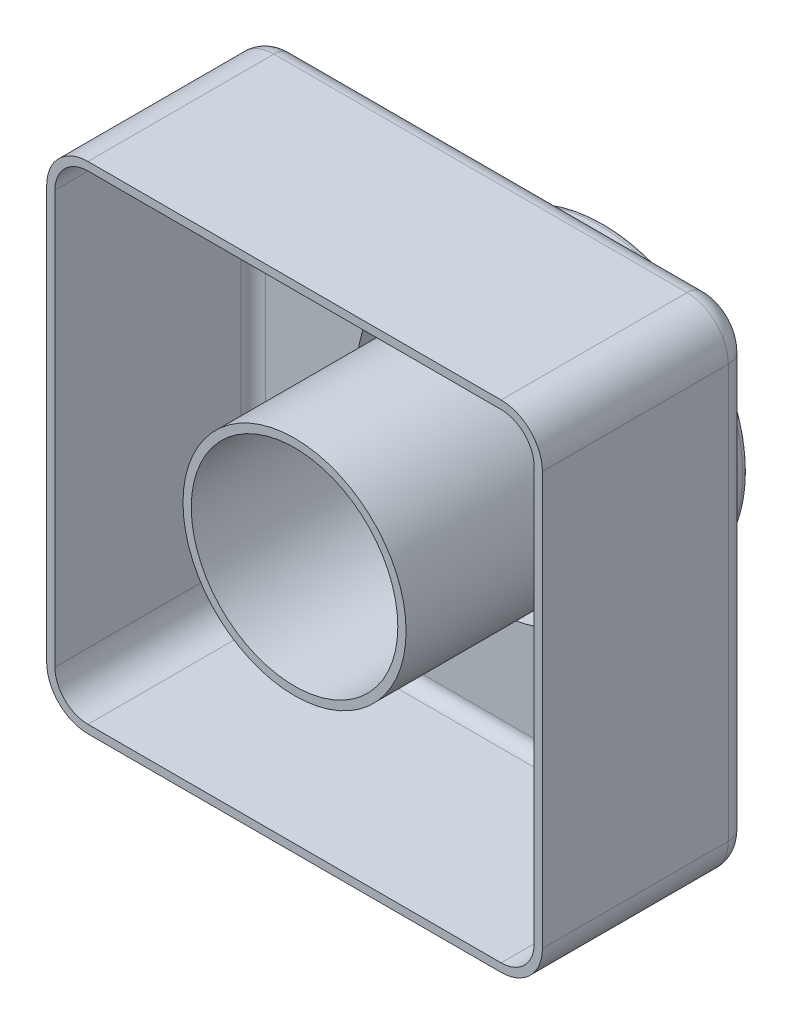
ISO-10303-21;
HEADER;
FILE_DESCRIPTION(('STEP AP214'),'2;1');
FILE_NAME('part.step','',(''),(''),'','','');
FILE_SCHEMA(('AUTOMOTIVE_DESIGN { 1 0 10303 214 1 1 1 1 }'));
ENDSEC;
DATA;
#1=APPLICATION_CONTEXT('core data for automotive mechanical design processes');
#2=APPLICATION_PROTOCOL_DEFINITION('international standard','automotive_design',2000,#1);
#3=PRODUCT_CONTEXT('',#1,'mechanical');
#4=PRODUCT('Part','Part','',(#3));
#5=PRODUCT_RELATED_PRODUCT_CATEGORY('part','',(#4));
#6=PRODUCT_DEFINITION_FORMATION('','',#4);
#7=PRODUCT_DEFINITION_CONTEXT('part definition',#1,'design');
#8=PRODUCT_DEFINITION('design','',#6,#7);
#9=PRODUCT_DEFINITION_SHAPE('','',#8);
#10=(LENGTH_UNIT() NAMED_UNIT(*) SI_UNIT(.MILLI.,.METRE.));
#11=(NAMED_UNIT(*) PLANE_ANGLE_UNIT() SI_UNIT($,.RADIAN.));
#12=(NAMED_UNIT(*) SI_UNIT($,.STERADIAN.) SOLID_ANGLE_UNIT());
#13=UNCERTAINTY_MEASURE_WITH_UNIT(LENGTH_MEASURE(1.E-05),#10,'distance_accuracy_value','');
#14=(GEOMETRIC_REPRESENTATION_CONTEXT(3) GLOBAL_UNCERTAINTY_ASSIGNED_CONTEXT((#13)) GLOBAL_UNIT_ASSIGNED_CONTEXT((#10,
#11,#12)) REPRESENTATION_CONTEXT('',''));
#15=CARTESIAN_POINT('',(0.,0.,0.));
#16=DIRECTION('',(0.,0.,1.));
#17=DIRECTION('',(1.,0.,0.));
#18=AXIS2_PLACEMENT_3D('',#15,#16,#17);
#19=CARTESIAN_POINT('',(0.,0.,50.));
#20=DIRECTION('',(0.,0.,1.));
#21=DIRECTION('',(1.,0.,0.));
#22=AXIS2_PLACEMENT_3D('',#19,#20,#21);
#23=PLANE('',#22);
#24=CARTESIAN_POINT('',(0.,0.,50.));
#25=DIRECTION('',(0.,0.,1.));
#26=DIRECTION('',(1.,0.,0.));
#27=AXIS2_PLACEMENT_3D('',#24,#25,#26);
#28=CIRCLE('',#27,27.);
#29=CARTESIAN_POINT('',(27.,0.,50.));
#30=VERTEX_POINT('',#29);
#31=EDGE_CURVE('E251',#30,#30,#28,.F.);
#32=ORIENTED_EDGE('',*,*,#31,.F.);
#33=EDGE_LOOP('',(#32));
#34=FACE_BOUND('',#33,.T.);
#35=CARTESIAN_POINT('',(0.,0.,50.));
#36=DIRECTION('',(0.,0.,-1.));
#37=DIRECTION('',(-1.,0.,0.));
#38=AXIS2_PLACEMENT_3D('',#35,#36,#37);
#39=CIRCLE('',#38,25.);
#40=CARTESIAN_POINT('',(-25.,0.,50.));
#41=VERTEX_POINT('',#40);
#42=EDGE_CURVE('E345',#41,#41,#39,.T.);
#43=ORIENTED_EDGE('',*,*,#42,.T.);
#44=EDGE_LOOP('',(#43));
#45=FACE_BOUND('',#44,.T.);
#46=ADVANCED_FACE('F41',(#34,#45),#23,.T.);
#47=CARTESIAN_POINT('',(-60.,60.,50.));
#48=DIRECTION('',(1.,0.,0.));
#49=DIRECTION('',(0.,1.,0.));
#50=AXIS2_PLACEMENT_3D('',#47,#48,#49);
#51=PLANE('',#50);
#52=DIRECTION('',(0.,0.,-1.));
#53=VECTOR('',#52,1.);
#54=CARTESIAN_POINT('',(-60.,50.,50.));
#55=LINE('',#54,#53);
#56=CARTESIAN_POINT('',(-60.,50.,50.));
#57=VERTEX_POINT('',#56);
#58=CARTESIAN_POINT('',(-60.,50.,5.));
#59=VERTEX_POINT('',#58);
#60=EDGE_CURVE('E392',#57,#59,#55,.T.);
#61=ORIENTED_EDGE('',*,*,#60,.T.);
#62=DIRECTION('',(0.,-1.,0.));
#63=VECTOR('',#62,1.);
#64=CARTESIAN_POINT('',(-60.,60.,5.));
#65=LINE('',#64,#63);
#66=CARTESIAN_POINT('',(-60.,-50.,5.));
#67=VERTEX_POINT('',#66);
#68=EDGE_CURVE('E464',#59,#67,#65,.T.);
#69=ORIENTED_EDGE('',*,*,#68,.T.);
#70=DIRECTION('',(0.,0.,-1.));
#71=VECTOR('',#70,1.);
#72=CARTESIAN_POINT('',(-60.,-50.,50.));
#73=LINE('',#72,#71);
#74=CARTESIAN_POINT('',(-60.,-50.,50.));
#75=VERTEX_POINT('',#74);
#76=EDGE_CURVE('E395',#67,#75,#73,.F.);
#77=ORIENTED_EDGE('',*,*,#76,.T.);
#78=DIRECTION('',(0.,-1.,0.));
#79=VECTOR('',#78,1.);
#80=CARTESIAN_POINT('',(-60.,60.,50.));
#81=LINE('',#80,#79);
#82=EDGE_CURVE('E349',#57,#75,#81,.T.);
#83=ORIENTED_EDGE('',*,*,#82,.F.);
#84=EDGE_LOOP('',(#61,#69,#77,#83));
#85=FACE_BOUND('',#84,.T.);
#86=ADVANCED_FACE('F556',(#85),#51,.F.);
#87=CARTESIAN_POINT('',(-60.,-60.,50.));
#88=DIRECTION('',(0.,1.,0.));
#89=DIRECTION('',(0.,0.,1.));
#90=AXIS2_PLACEMENT_3D('',#87,#88,#89);
#91=PLANE('',#90);
#92=DIRECTION('',(0.,0.,-1.));
#93=VECTOR('',#92,1.);
#94=CARTESIAN_POINT('',(-50.,-60.,50.));
#95=LINE('',#94,#93);
#96=CARTESIAN_POINT('',(-50.,-60.,50.));
#97=VERTEX_POINT('',#96);
#98=CARTESIAN_POINT('',(-50.,-60.,5.));
#99=VERTEX_POINT('',#98);
#100=EDGE_CURVE('E388',#97,#99,#95,.T.);
#101=ORIENTED_EDGE('',*,*,#100,.T.);
#102=DIRECTION('',(1.,0.,0.));
#103=VECTOR('',#102,1.);
#104=CARTESIAN_POINT('',(-60.,-60.,5.));
#105=LINE('',#104,#103);
#106=CARTESIAN_POINT('',(50.,-60.,5.));
#107=VERTEX_POINT('',#106);
#108=EDGE_CURVE('E461',#99,#107,#105,.T.);
#109=ORIENTED_EDGE('',*,*,#108,.T.);
#110=DIRECTION('',(0.,0.,-1.));
#111=VECTOR('',#110,1.);
#112=CARTESIAN_POINT('',(50.,-60.,50.));
#113=LINE('',#112,#111);
#114=CARTESIAN_POINT('',(50.,-60.,50.));
#115=VERTEX_POINT('',#114);
#116=EDGE_CURVE('E385',#107,#115,#113,.F.);
#117=ORIENTED_EDGE('',*,*,#116,.T.);
#118=DIRECTION('',(1.,0.,0.));
#119=VECTOR('',#118,1.);
#120=CARTESIAN_POINT('',(-60.,-60.,50.));
#121=LINE('',#120,#119);
#122=EDGE_CURVE('E359',#97,#115,#121,.T.);
#123=ORIENTED_EDGE('',*,*,#122,.F.);
#124=EDGE_LOOP('',(#101,#109,#117,#123));
#125=FACE_BOUND('',#124,.T.);
#126=ADVANCED_FACE('F516',(#125),#91,.F.);
#127=CARTESIAN_POINT('',(60.,60.,50.));
#128=DIRECTION('',(-1.,0.,0.));
#129=DIRECTION('',(0.,-1.,0.));
#130=AXIS2_PLACEMENT_3D('',#127,#128,#129);
#131=PLANE('',#130);
#132=DIRECTION('',(0.,0.,-1.));
#133=VECTOR('',#132,1.);
#134=CARTESIAN_POINT('',(60.,-50.,50.));
#135=LINE('',#134,#133);
#136=CARTESIAN_POINT('',(60.,-50.,50.));
#137=VERTEX_POINT('',#136);
#138=CARTESIAN_POINT('',(60.,-50.,5.));
#139=VERTEX_POINT('',#138);
#140=EDGE_CURVE('E413',#137,#139,#135,.T.);
#141=ORIENTED_EDGE('',*,*,#140,.T.);
#142=DIRECTION('',(0.,1.,0.));
#143=VECTOR('',#142,1.);
#144=CARTESIAN_POINT('',(60.,60.,5.));
#145=LINE('',#144,#143);
#146=CARTESIAN_POINT('',(60.,50.,5.));
#147=VERTEX_POINT('',#146);
#148=EDGE_CURVE('E51',#139,#147,#145,.T.);
#149=ORIENTED_EDGE('',*,*,#148,.T.);
#150=DIRECTION('',(0.,0.,-1.));
#151=VECTOR('',#150,1.);
#152=CARTESIAN_POINT('',(60.,50.,50.));
#153=LINE('',#152,#151);
#154=CARTESIAN_POINT('',(60.,50.,50.));
#155=VERTEX_POINT('',#154);
#156=EDGE_CURVE('E410',#147,#155,#153,.F.);
#157=ORIENTED_EDGE('',*,*,#156,.T.);
#158=DIRECTION('',(0.,1.,0.));
#159=VECTOR('',#158,1.);
#160=CARTESIAN_POINT('',(60.,60.,50.));
#161=LINE('',#160,#159);
#162=EDGE_CURVE('E363',#137,#155,#161,.T.);
#163=ORIENTED_EDGE('',*,*,#162,.F.);
#164=EDGE_LOOP('',(#141,#149,#157,#163));
#165=FACE_BOUND('',#164,.T.);
#166=ADVANCED_FACE('F529',(#165),#131,.F.);
#167=CARTESIAN_POINT('',(-60.,60.,50.));
#168=DIRECTION('',(0.,-1.,0.));
#169=DIRECTION('',(0.,0.,-1.));
#170=AXIS2_PLACEMENT_3D('',#167,#168,#169);
#171=PLANE('',#170);
#172=DIRECTION('',(0.,0.,-1.));
#173=VECTOR('',#172,1.);
#174=CARTESIAN_POINT('',(50.,60.,50.));
#175=LINE('',#174,#173);
#176=CARTESIAN_POINT('',(50.,60.,50.));
#177=VERTEX_POINT('',#176);
#178=CARTESIAN_POINT('',(50.,60.,5.));
#179=VERTEX_POINT('',#178);
#180=EDGE_CURVE('E417',#177,#179,#175,.T.);
#181=ORIENTED_EDGE('',*,*,#180,.T.);
#182=DIRECTION('',(-1.,0.,0.));
#183=VECTOR('',#182,1.);
#184=CARTESIAN_POINT('',(-60.,60.,5.));
#185=LINE('',#184,#183);
#186=CARTESIAN_POINT('',(-50.,60.,5.));
#187=VERTEX_POINT('',#186);
#188=EDGE_CURVE('E11',#179,#187,#185,.T.);
#189=ORIENTED_EDGE('',*,*,#188,.T.);
#190=DIRECTION('',(0.,0.,-1.));
#191=VECTOR('',#190,1.);
#192=CARTESIAN_POINT('',(-50.,60.,50.));
#193=LINE('',#192,#191);
#194=CARTESIAN_POINT('',(-50.,60.,50.));
#195=VERTEX_POINT('',#194);
#196=EDGE_CURVE('E421',#187,#195,#193,.F.);
#197=ORIENTED_EDGE('',*,*,#196,.T.);
#198=DIRECTION('',(-1.,0.,0.));
#199=VECTOR('',#198,1.);
#200=CARTESIAN_POINT('',(-60.,60.,50.));
#201=LINE('',#200,#199);
#202=EDGE_CURVE('E355',#177,#195,#201,.T.);
#203=ORIENTED_EDGE('',*,*,#202,.F.);
#204=EDGE_LOOP('',(#181,#189,#197,#203));
#205=FACE_BOUND('',#204,.T.);
#206=ADVANCED_FACE('F551',(#205),#171,.F.);
#207=DIRECTION('',(0.,-1.,0.));
#208=VECTOR('',#207,1.);
#209=CARTESIAN_POINT('',(-58.,60.,50.));
#210=LINE('',#209,#208);
#211=CARTESIAN_POINT('',(-58.,50.,50.));
#212=VERTEX_POINT('',#211);
#213=CARTESIAN_POINT('',(-58.,-50.,50.));
#214=VERTEX_POINT('',#213);
#215=EDGE_CURVE('E228',#212,#214,#210,.T.);
#216=ORIENTED_EDGE('',*,*,#215,.F.);
#217=CARTESIAN_POINT('',(-50.,50.,50.));
#218=DIRECTION('',(0.,0.,1.));
#219=DIRECTION('',(1.,0.,0.));
#220=AXIS2_PLACEMENT_3D('',#217,#218,#219);
#221=CIRCLE('',#220,8.);
#222=CARTESIAN_POINT('',(-50.,58.,50.));
#223=VERTEX_POINT('',#222);
#224=EDGE_CURVE('E335',#223,#212,#221,.T.);
#225=ORIENTED_EDGE('',*,*,#224,.F.);
#226=DIRECTION('',(-1.,0.,0.));
#227=VECTOR('',#226,1.);
#228=CARTESIAN_POINT('',(-60.,58.,50.));
#229=LINE('',#228,#227);
#230=CARTESIAN_POINT('',(50.,58.,50.));
#231=VERTEX_POINT('',#230);
#232=EDGE_CURVE('E59',#231,#223,#229,.T.);
#233=ORIENTED_EDGE('',*,*,#232,.F.);
#234=CARTESIAN_POINT('',(50.,50.,50.));
#235=DIRECTION('',(0.,0.,1.));
#236=DIRECTION('',(1.,0.,0.));
#237=AXIS2_PLACEMENT_3D('',#234,#235,#236);
#238=CIRCLE('',#237,8.);
#239=CARTESIAN_POINT('',(58.,50.,50.));
#240=VERTEX_POINT('',#239);
#241=EDGE_CURVE('E232',#240,#231,#238,.T.);
#242=ORIENTED_EDGE('',*,*,#241,.F.);
#243=DIRECTION('',(0.,1.,0.));
#244=VECTOR('',#243,1.);
#245=CARTESIAN_POINT('',(58.,60.,50.));
#246=LINE('',#245,#244);
#247=CARTESIAN_POINT('',(58.,-50.,50.));
#248=VERTEX_POINT('',#247);
#249=EDGE_CURVE('E332',#248,#240,#246,.T.);
#250=ORIENTED_EDGE('',*,*,#249,.F.);
#251=CARTESIAN_POINT('',(50.,-50.,50.));
#252=DIRECTION('',(0.,0.,1.));
#253=DIRECTION('',(1.,0.,0.));
#254=AXIS2_PLACEMENT_3D('',#251,#252,#253);
#255=CIRCLE('',#254,8.);
#256=CARTESIAN_POINT('',(50.,-58.,50.));
#257=VERTEX_POINT('',#256);
#258=EDGE_CURVE('E328',#257,#248,#255,.T.);
#259=ORIENTED_EDGE('',*,*,#258,.F.);
#260=DIRECTION('',(1.,0.,0.));
#261=VECTOR('',#260,1.);
#262=CARTESIAN_POINT('',(-60.,-58.,50.));
#263=LINE('',#262,#261);
#264=CARTESIAN_POINT('',(-50.,-58.,50.));
#265=VERTEX_POINT('',#264);
#266=EDGE_CURVE('E323',#265,#257,#263,.T.);
#267=ORIENTED_EDGE('',*,*,#266,.F.);
#268=CARTESIAN_POINT('',(-50.,-50.,50.));
#269=DIRECTION('',(0.,0.,1.));
#270=DIRECTION('',(1.,0.,0.));
#271=AXIS2_PLACEMENT_3D('',#268,#269,#270);
#272=CIRCLE('',#271,8.);
#273=EDGE_CURVE('E324',#214,#265,#272,.T.);
#274=ORIENTED_EDGE('',*,*,#273,.F.);
#275=EDGE_LOOP('',(#216,#225,#233,#242,#250,#259,#267,#274));
#276=FACE_BOUND('',#275,.T.);
#277=ORIENTED_EDGE('',*,*,#82,.T.);
#278=CARTESIAN_POINT('',(-50.,-50.,50.));
#279=DIRECTION('',(0.,0.,1.));
#280=DIRECTION('',(1.,0.,0.));
#281=AXIS2_PLACEMENT_3D('',#278,#279,#280);
#282=CIRCLE('',#281,10.);
#283=EDGE_CURVE('E407',#75,#97,#282,.T.);
#284=ORIENTED_EDGE('',*,*,#283,.T.);
#285=ORIENTED_EDGE('',*,*,#122,.T.);
#286=CARTESIAN_POINT('',(50.,-50.,50.));
#287=DIRECTION('',(0.,0.,1.));
#288=DIRECTION('',(1.,0.,0.));
#289=AXIS2_PLACEMENT_3D('',#286,#287,#288);
#290=CIRCLE('',#289,10.);
#291=EDGE_CURVE('E404',#115,#137,#290,.T.);
#292=ORIENTED_EDGE('',*,*,#291,.T.);
#293=ORIENTED_EDGE('',*,*,#162,.T.);
#294=CARTESIAN_POINT('',(50.,50.,50.));
#295=DIRECTION('',(0.,0.,1.));
#296=DIRECTION('',(1.,0.,0.));
#297=AXIS2_PLACEMENT_3D('',#294,#295,#296);
#298=CIRCLE('',#297,10.);
#299=EDGE_CURVE('E398',#155,#177,#298,.T.);
#300=ORIENTED_EDGE('',*,*,#299,.T.);
#301=ORIENTED_EDGE('',*,*,#202,.T.);
#302=CARTESIAN_POINT('',(-50.,50.,50.));
#303=DIRECTION('',(0.,0.,1.));
#304=DIRECTION('',(1.,0.,0.));
#305=AXIS2_PLACEMENT_3D('',#302,#303,#304);
#306=CIRCLE('',#305,10.);
#307=EDGE_CURVE('E401',#195,#57,#306,.T.);
#308=ORIENTED_EDGE('',*,*,#307,.T.);
#309=EDGE_LOOP('',(#277,#284,#285,#292,#293,#300,#301,#308));
#310=FACE_BOUND('',#309,.T.);
#311=ADVANCED_FACE('F520',(#276,#310),#23,.T.);
#312=CARTESIAN_POINT('',(0.,0.,0.));
#313=DIRECTION('',(0.,0.,1.));
#314=DIRECTION('',(1.,0.,0.));
#315=AXIS2_PLACEMENT_3D('',#312,#313,#314);
#316=PLANE('',#315);
#317=CARTESIAN_POINT('',(50.,-50.,0.));
#318=DIRECTION('',(0.,0.,1.));
#319=DIRECTION('',(1.,0.,0.));
#320=AXIS2_PLACEMENT_3D('',#317,#318,#319);
#321=CIRCLE('',#320,5.);
#322=CARTESIAN_POINT('',(55.,-50.,0.));
#323=VERTEX_POINT('',#322);
#324=CARTESIAN_POINT('',(50.,-55.,0.));
#325=VERTEX_POINT('',#324);
#326=EDGE_CURVE('E443',#323,#325,#321,.F.);
#327=ORIENTED_EDGE('',*,*,#326,.T.);
#328=DIRECTION('',(1.,0.,0.));
#329=VECTOR('',#328,1.);
#330=CARTESIAN_POINT('',(0.,-55.,0.));
#331=LINE('',#330,#329);
#332=CARTESIAN_POINT('',(-50.,-55.,0.));
#333=VERTEX_POINT('',#332);
#334=EDGE_CURVE('E446',#325,#333,#331,.F.);
#335=ORIENTED_EDGE('',*,*,#334,.T.);
#336=CARTESIAN_POINT('',(-50.,-50.,0.));
#337=DIRECTION('',(0.,0.,1.));
#338=DIRECTION('',(1.,0.,0.));
#339=AXIS2_PLACEMENT_3D('',#336,#337,#338);
#340=CIRCLE('',#339,5.);
#341=CARTESIAN_POINT('',(-55.,-50.,0.));
#342=VERTEX_POINT('',#341);
#343=EDGE_CURVE('E440',#333,#342,#340,.F.);
#344=ORIENTED_EDGE('',*,*,#343,.T.);
#345=DIRECTION('',(0.,-1.,0.));
#346=VECTOR('',#345,1.);
#347=CARTESIAN_POINT('',(-55.,0.,0.));
#348=LINE('',#347,#346);
#349=CARTESIAN_POINT('',(-55.,50.,0.));
#350=VERTEX_POINT('',#349);
#351=EDGE_CURVE('E437',#342,#350,#348,.F.);
#352=ORIENTED_EDGE('',*,*,#351,.T.);
#353=CARTESIAN_POINT('',(-50.,50.,0.));
#354=DIRECTION('',(0.,0.,1.));
#355=DIRECTION('',(1.,0.,0.));
#356=AXIS2_PLACEMENT_3D('',#353,#354,#355);
#357=CIRCLE('',#356,5.);
#358=CARTESIAN_POINT('',(-50.,55.,0.));
#359=VERTEX_POINT('',#358);
#360=EDGE_CURVE('E427',#350,#359,#357,.F.);
#361=ORIENTED_EDGE('',*,*,#360,.T.);
#362=DIRECTION('',(-1.,0.,0.));
#363=VECTOR('',#362,1.);
#364=CARTESIAN_POINT('',(0.,55.,0.));
#365=LINE('',#364,#363);
#366=CARTESIAN_POINT('',(50.,55.,0.));
#367=VERTEX_POINT('',#366);
#368=EDGE_CURVE('E424',#359,#367,#365,.F.);
#369=ORIENTED_EDGE('',*,*,#368,.T.);
#370=CARTESIAN_POINT('',(50.,50.,0.));
#371=DIRECTION('',(0.,0.,1.));
#372=DIRECTION('',(1.,0.,0.));
#373=AXIS2_PLACEMENT_3D('',#370,#371,#372);
#374=CIRCLE('',#373,5.);
#375=CARTESIAN_POINT('',(55.,50.,0.));
#376=VERTEX_POINT('',#375);
#377=EDGE_CURVE('E430',#367,#376,#374,.F.);
#378=ORIENTED_EDGE('',*,*,#377,.T.);
#379=DIRECTION('',(0.,1.,0.));
#380=VECTOR('',#379,1.);
#381=CARTESIAN_POINT('',(55.,0.,0.));
#382=LINE('',#381,#380);
#383=EDGE_CURVE('E434',#376,#323,#382,.F.);
#384=ORIENTED_EDGE('',*,*,#383,.T.);
#385=EDGE_LOOP('',(#327,#335,#344,#352,#361,#369,#378,#384));
#386=FACE_BOUND('',#385,.T.);
#387=CARTESIAN_POINT('',(0.,0.,0.));
#388=DIRECTION('',(0.,0.,-1.));
#389=DIRECTION('',(-1.,0.,0.));
#390=AXIS2_PLACEMENT_3D('',#387,#388,#389);
#391=CIRCLE('',#390,35.);
#392=CARTESIAN_POINT('',(-35.,0.,0.));
#393=VERTEX_POINT('',#392);
#394=EDGE_CURVE('E350',#393,#393,#391,.T.);
#395=ORIENTED_EDGE('',*,*,#394,.F.);
#396=EDGE_LOOP('',(#395));
#397=FACE_BOUND('',#396,.T.);
#398=ADVANCED_FACE('F654',(#386,#397),#316,.F.);
#399=CARTESIAN_POINT('',(0.,0.,-25.));
#400=DIRECTION('',(0.,0.,1.));
#401=DIRECTION('',(1.,0.,0.));
#402=AXIS2_PLACEMENT_3D('',#399,#400,#401);
#403=CYLINDRICAL_SURFACE('',#402,35.);
#404=CARTESIAN_POINT('',(0.,0.,-23.5));
#405=DIRECTION('',(0.,0.,-1.));
#406=DIRECTION('',(-1.,0.,0.));
#407=AXIS2_PLACEMENT_3D('',#404,#405,#406);
#408=CIRCLE('',#407,35.);
#409=CARTESIAN_POINT('',(-35.,0.,-23.5));
#410=VERTEX_POINT('',#409);
#411=EDGE_CURVE('E377',#410,#410,#408,.F.);
#412=ORIENTED_EDGE('',*,*,#411,.T.);
#413=EDGE_LOOP('',(#412));
#414=FACE_BOUND('',#413,.T.);
#415=ORIENTED_EDGE('',*,*,#394,.T.);
#416=EDGE_LOOP('',(#415));
#417=FACE_BOUND('',#416,.T.);
#418=ADVANCED_FACE('F646',(#414,#417),#403,.T.);
#419=CARTESIAN_POINT('',(0.,0.,-25.));
#420=DIRECTION('',(0.,0.,-1.));
#421=DIRECTION('',(-1.,0.,0.));
#422=AXIS2_PLACEMENT_3D('',#419,#420,#421);
#423=PLANE('',#422);
#424=CARTESIAN_POINT('',(0.,0.,-25.));
#425=DIRECTION('',(0.,0.,-1.));
#426=DIRECTION('',(-1.,0.,0.));
#427=AXIS2_PLACEMENT_3D('',#424,#425,#426);
#428=CIRCLE('',#427,33.5);
#429=CARTESIAN_POINT('',(-33.5,0.,-25.));
#430=VERTEX_POINT('',#429);
#431=EDGE_CURVE('E373',#430,#430,#428,.T.);
#432=ORIENTED_EDGE('',*,*,#431,.T.);
#433=EDGE_LOOP('',(#432));
#434=FACE_BOUND('',#433,.T.);
#435=CARTESIAN_POINT('',(0.,0.,-25.));
#436=DIRECTION('',(0.,0.,-1.));
#437=DIRECTION('',(-1.,0.,0.));
#438=AXIS2_PLACEMENT_3D('',#435,#436,#437);
#439=CIRCLE('',#438,26.5);
#440=CARTESIAN_POINT('',(-26.5,0.,-25.));
#441=VERTEX_POINT('',#440);
#442=EDGE_CURVE('E354',#441,#441,#439,.F.);
#443=ORIENTED_EDGE('',*,*,#442,.T.);
#444=EDGE_LOOP('',(#443));
#445=FACE_BOUND('',#444,.T.);
#446=ADVANCED_FACE('F638',(#434,#445),#423,.T.);
#447=CARTESIAN_POINT('',(0.,0.,50.));
#448=DIRECTION('',(0.,0.,-1.));
#449=DIRECTION('',(-1.,0.,0.));
#450=AXIS2_PLACEMENT_3D('',#447,#448,#449);
#451=CYLINDRICAL_SURFACE('',#450,25.);
#452=CARTESIAN_POINT('',(0.,0.,-23.5));
#453=DIRECTION('',(0.,0.,-1.));
#454=DIRECTION('',(-1.,0.,0.));
#455=AXIS2_PLACEMENT_3D('',#452,#453,#454);
#456=CIRCLE('',#455,25.);
#457=CARTESIAN_POINT('',(-25.,0.,-23.5));
#458=VERTEX_POINT('',#457);
#459=EDGE_CURVE('E381',#458,#458,#456,.T.);
#460=ORIENTED_EDGE('',*,*,#459,.T.);
#461=EDGE_LOOP('',(#460));
#462=FACE_BOUND('',#461,.T.);
#463=ORIENTED_EDGE('',*,*,#42,.F.);
#464=EDGE_LOOP('',(#463));
#465=FACE_BOUND('',#464,.T.);
#466=ADVANCED_FACE('F572',(#462,#465),#451,.F.);
#467=CARTESIAN_POINT('',(0.,0.,-23.5));
#468=DIRECTION('',(0.,0.,-1.));
#469=DIRECTION('',(-1.,0.,0.));
#470=AXIS2_PLACEMENT_3D('',#467,#468,#469);
#471=TOROIDAL_SURFACE('',#470,33.5,1.5);
#472=ORIENTED_EDGE('',*,*,#411,.F.);
#473=EDGE_LOOP('',(#472));
#474=FACE_BOUND('',#473,.T.);
#475=ORIENTED_EDGE('',*,*,#431,.F.);
#476=EDGE_LOOP('',(#475));
#477=FACE_BOUND('',#476,.T.);
#478=ADVANCED_FACE('F568',(#474,#477),#471,.T.);
#479=CARTESIAN_POINT('',(0.,0.,-23.5));
#480=DIRECTION('',(0.,0.,-1.));
#481=DIRECTION('',(-1.,0.,0.));
#482=AXIS2_PLACEMENT_3D('',#479,#480,#481);
#483=TOROIDAL_SURFACE('',#482,26.5,1.5);
#484=ORIENTED_EDGE('',*,*,#442,.F.);
#485=EDGE_LOOP('',(#484));
#486=FACE_BOUND('',#485,.T.);
#487=ORIENTED_EDGE('',*,*,#459,.F.);
#488=EDGE_LOOP('',(#487));
#489=FACE_BOUND('',#488,.T.);
#490=ADVANCED_FACE('F571',(#486,#489),#483,.T.);
#491=CARTESIAN_POINT('',(-50.,-50.,50.));
#492=DIRECTION('',(0.,0.,-1.));
#493=DIRECTION('',(-1.,0.,0.));
#494=AXIS2_PLACEMENT_3D('',#491,#492,#493);
#495=CYLINDRICAL_SURFACE('',#494,10.);
#496=ORIENTED_EDGE('',*,*,#76,.F.);
#497=CARTESIAN_POINT('',(-50.,-50.,5.));
#498=DIRECTION('',(0.,0.,1.));
#499=DIRECTION('',(1.,0.,0.));
#500=AXIS2_PLACEMENT_3D('',#497,#498,#499);
#501=CIRCLE('',#500,10.);
#502=EDGE_CURVE('E456',#67,#99,#501,.T.);
#503=ORIENTED_EDGE('',*,*,#502,.T.);
#504=ORIENTED_EDGE('',*,*,#100,.F.);
#505=ORIENTED_EDGE('',*,*,#283,.F.);
#506=EDGE_LOOP('',(#496,#503,#504,#505));
#507=FACE_BOUND('',#506,.T.);
#508=ADVANCED_FACE('F512',(#507),#495,.T.);
#509=CARTESIAN_POINT('',(50.,-50.,50.));
#510=DIRECTION('',(0.,0.,-1.));
#511=DIRECTION('',(-1.,0.,0.));
#512=AXIS2_PLACEMENT_3D('',#509,#510,#511);
#513=CYLINDRICAL_SURFACE('',#512,10.);
#514=ORIENTED_EDGE('',*,*,#116,.F.);
#515=CARTESIAN_POINT('',(50.,-50.,5.));
#516=DIRECTION('',(0.,0.,1.));
#517=DIRECTION('',(1.,0.,0.));
#518=AXIS2_PLACEMENT_3D('',#515,#516,#517);
#519=CIRCLE('',#518,10.);
#520=EDGE_CURVE('E453',#107,#139,#519,.T.);
#521=ORIENTED_EDGE('',*,*,#520,.T.);
#522=ORIENTED_EDGE('',*,*,#140,.F.);
#523=ORIENTED_EDGE('',*,*,#291,.F.);
#524=EDGE_LOOP('',(#514,#521,#522,#523));
#525=FACE_BOUND('',#524,.T.);
#526=ADVANCED_FACE('F524',(#525),#513,.T.);
#527=CARTESIAN_POINT('',(-50.,50.,50.));
#528=DIRECTION('',(0.,0.,-1.));
#529=DIRECTION('',(-1.,0.,0.));
#530=AXIS2_PLACEMENT_3D('',#527,#528,#529);
#531=CYLINDRICAL_SURFACE('',#530,10.);
#532=ORIENTED_EDGE('',*,*,#196,.F.);
#533=CARTESIAN_POINT('',(-50.,50.,5.));
#534=DIRECTION('',(0.,0.,1.));
#535=DIRECTION('',(1.,0.,0.));
#536=AXIS2_PLACEMENT_3D('',#533,#534,#535);
#537=CIRCLE('',#536,10.);
#538=EDGE_CURVE('E67',#187,#59,#537,.T.);
#539=ORIENTED_EDGE('',*,*,#538,.T.);
#540=ORIENTED_EDGE('',*,*,#60,.F.);
#541=ORIENTED_EDGE('',*,*,#307,.F.);
#542=EDGE_LOOP('',(#532,#539,#540,#541));
#543=FACE_BOUND('',#542,.T.);
#544=ADVANCED_FACE('F554',(#543),#531,.T.);
#545=CARTESIAN_POINT('',(50.,50.,50.));
#546=DIRECTION('',(0.,0.,-1.));
#547=DIRECTION('',(-1.,0.,0.));
#548=AXIS2_PLACEMENT_3D('',#545,#546,#547);
#549=CYLINDRICAL_SURFACE('',#548,10.);
#550=ORIENTED_EDGE('',*,*,#156,.F.);
#551=CARTESIAN_POINT('',(50.,50.,5.));
#552=DIRECTION('',(0.,0.,1.));
#553=DIRECTION('',(1.,0.,0.));
#554=AXIS2_PLACEMENT_3D('',#551,#552,#553);
#555=CIRCLE('',#554,10.);
#556=EDGE_CURVE('E449',#147,#179,#555,.T.);
#557=ORIENTED_EDGE('',*,*,#556,.T.);
#558=ORIENTED_EDGE('',*,*,#180,.F.);
#559=ORIENTED_EDGE('',*,*,#299,.F.);
#560=EDGE_LOOP('',(#550,#557,#558,#559));
#561=FACE_BOUND('',#560,.T.);
#562=ADVANCED_FACE('F547',(#561),#549,.T.);
#563=CARTESIAN_POINT('',(-50.,-50.,5.));
#564=DIRECTION('',(0.,0.,1.));
#565=DIRECTION('',(1.,0.,0.));
#566=AXIS2_PLACEMENT_3D('',#563,#564,#565);
#567=DEGENERATE_TOROIDAL_SURFACE('',#566,5.,5.,.T.);
#568=CARTESIAN_POINT('',(-50.,-55.,5.));
#569=DIRECTION('',(1.,0.,0.));
#570=DIRECTION('',(0.,0.,-1.));
#571=AXIS2_PLACEMENT_3D('',#568,#569,#570);
#572=CIRCLE('',#571,5.);
#573=EDGE_CURVE('E491',#99,#333,#572,.T.);
#574=ORIENTED_EDGE('',*,*,#573,.F.);
#575=ORIENTED_EDGE('',*,*,#502,.F.);
#576=CARTESIAN_POINT('',(-55.,-50.,5.));
#577=DIRECTION('',(0.,1.,0.));
#578=DIRECTION('',(0.,0.,1.));
#579=AXIS2_PLACEMENT_3D('',#576,#577,#578);
#580=CIRCLE('',#579,5.);
#581=EDGE_CURVE('E45',#342,#67,#580,.T.);
#582=ORIENTED_EDGE('',*,*,#581,.F.);
#583=ORIENTED_EDGE('',*,*,#343,.F.);
#584=EDGE_LOOP('',(#574,#575,#582,#583));
#585=FACE_BOUND('',#584,.T.);
#586=ADVANCED_FACE('F43',(#585),#567,.T.);
#587=CARTESIAN_POINT('',(-55.,60.,5.));
#588=DIRECTION('',(0.,-1.,0.));
#589=DIRECTION('',(1.,0.,0.));
#590=AXIS2_PLACEMENT_3D('',#587,#588,#589);
#591=CYLINDRICAL_SURFACE('',#590,5.);
#592=ORIENTED_EDGE('',*,*,#581,.T.);
#593=ORIENTED_EDGE('',*,*,#68,.F.);
#594=CARTESIAN_POINT('',(-55.,50.,5.));
#595=DIRECTION('',(0.,1.,0.));
#596=DIRECTION('',(0.,0.,1.));
#597=AXIS2_PLACEMENT_3D('',#594,#595,#596);
#598=CIRCLE('',#597,5.);
#599=EDGE_CURVE('E488',#350,#59,#598,.T.);
#600=ORIENTED_EDGE('',*,*,#599,.F.);
#601=ORIENTED_EDGE('',*,*,#351,.F.);
#602=EDGE_LOOP('',(#592,#593,#600,#601));
#603=FACE_BOUND('',#602,.T.);
#604=ADVANCED_FACE('F504',(#603),#591,.T.);
#605=CARTESIAN_POINT('',(-60.,-55.,5.));
#606=DIRECTION('',(1.,0.,0.));
#607=DIRECTION('',(0.,0.,-1.));
#608=AXIS2_PLACEMENT_3D('',#605,#606,#607);
#609=CYLINDRICAL_SURFACE('',#608,5.);
#610=ORIENTED_EDGE('',*,*,#573,.T.);
#611=ORIENTED_EDGE('',*,*,#334,.F.);
#612=CARTESIAN_POINT('',(50.,-55.,5.));
#613=DIRECTION('',(1.,0.,0.));
#614=DIRECTION('',(0.,0.,-1.));
#615=AXIS2_PLACEMENT_3D('',#612,#613,#614);
#616=CIRCLE('',#615,5.);
#617=EDGE_CURVE('E484',#107,#325,#616,.T.);
#618=ORIENTED_EDGE('',*,*,#617,.F.);
#619=ORIENTED_EDGE('',*,*,#108,.F.);
#620=EDGE_LOOP('',(#610,#611,#618,#619));
#621=FACE_BOUND('',#620,.T.);
#622=ADVANCED_FACE('F598',(#621),#609,.T.);
#623=CARTESIAN_POINT('',(-50.,50.,5.));
#624=DIRECTION('',(0.,0.,1.));
#625=DIRECTION('',(1.,0.,0.));
#626=AXIS2_PLACEMENT_3D('',#623,#624,#625);
#627=DEGENERATE_TOROIDAL_SURFACE('',#626,5.,5.,.T.);
#628=ORIENTED_EDGE('',*,*,#599,.T.);
#629=ORIENTED_EDGE('',*,*,#538,.F.);
#630=CARTESIAN_POINT('',(-50.,55.,5.));
#631=DIRECTION('',(1.,0.,0.));
#632=DIRECTION('',(0.,0.,-1.));
#633=AXIS2_PLACEMENT_3D('',#630,#631,#632);
#634=CIRCLE('',#633,5.);
#635=EDGE_CURVE('E480',#359,#187,#634,.T.);
#636=ORIENTED_EDGE('',*,*,#635,.F.);
#637=ORIENTED_EDGE('',*,*,#360,.F.);
#638=EDGE_LOOP('',(#628,#629,#636,#637));
#639=FACE_BOUND('',#638,.T.);
#640=ADVANCED_FACE('F595',(#639),#627,.T.);
#641=CARTESIAN_POINT('',(50.,-50.,5.));
#642=DIRECTION('',(0.,0.,1.));
#643=DIRECTION('',(1.,0.,0.));
#644=AXIS2_PLACEMENT_3D('',#641,#642,#643);
#645=DEGENERATE_TOROIDAL_SURFACE('',#644,5.,5.,.T.);
#646=ORIENTED_EDGE('',*,*,#617,.T.);
#647=ORIENTED_EDGE('',*,*,#326,.F.);
#648=CARTESIAN_POINT('',(55.,-50.,5.));
#649=DIRECTION('',(0.,1.,0.));
#650=DIRECTION('',(0.,0.,1.));
#651=AXIS2_PLACEMENT_3D('',#648,#649,#650);
#652=CIRCLE('',#651,5.);
#653=EDGE_CURVE('E476',#139,#323,#652,.T.);
#654=ORIENTED_EDGE('',*,*,#653,.F.);
#655=ORIENTED_EDGE('',*,*,#520,.F.);
#656=EDGE_LOOP('',(#646,#647,#654,#655));
#657=FACE_BOUND('',#656,.T.);
#658=ADVANCED_FACE('F534',(#657),#645,.T.);
#659=CARTESIAN_POINT('',(-60.,55.,5.));
#660=DIRECTION('',(-1.,0.,0.));
#661=DIRECTION('',(0.,0.,1.));
#662=AXIS2_PLACEMENT_3D('',#659,#660,#661);
#663=CYLINDRICAL_SURFACE('',#662,5.);
#664=ORIENTED_EDGE('',*,*,#635,.T.);
#665=ORIENTED_EDGE('',*,*,#188,.F.);
#666=CARTESIAN_POINT('',(50.,55.,5.));
#667=DIRECTION('',(1.,0.,0.));
#668=DIRECTION('',(0.,0.,-1.));
#669=AXIS2_PLACEMENT_3D('',#666,#667,#668);
#670=CIRCLE('',#669,5.);
#671=EDGE_CURVE('E472',#367,#179,#670,.T.);
#672=ORIENTED_EDGE('',*,*,#671,.F.);
#673=ORIENTED_EDGE('',*,*,#368,.F.);
#674=EDGE_LOOP('',(#664,#665,#672,#673));
#675=FACE_BOUND('',#674,.T.);
#676=ADVANCED_FACE('F589',(#675),#663,.T.);
#677=CARTESIAN_POINT('',(55.,60.,5.));
#678=DIRECTION('',(0.,1.,0.));
#679=DIRECTION('',(-1.,0.,0.));
#680=AXIS2_PLACEMENT_3D('',#677,#678,#679);
#681=CYLINDRICAL_SURFACE('',#680,5.);
#682=ORIENTED_EDGE('',*,*,#653,.T.);
#683=ORIENTED_EDGE('',*,*,#383,.F.);
#684=CARTESIAN_POINT('',(55.,50.,5.));
#685=DIRECTION('',(0.,1.,0.));
#686=DIRECTION('',(0.,0.,1.));
#687=AXIS2_PLACEMENT_3D('',#684,#685,#686);
#688=CIRCLE('',#687,5.);
#689=EDGE_CURVE('E469',#147,#376,#688,.T.);
#690=ORIENTED_EDGE('',*,*,#689,.F.);
#691=ORIENTED_EDGE('',*,*,#148,.F.);
#692=EDGE_LOOP('',(#682,#683,#690,#691));
#693=FACE_BOUND('',#692,.T.);
#694=ADVANCED_FACE('F538',(#693),#681,.T.);
#695=CARTESIAN_POINT('',(50.,50.,5.));
#696=DIRECTION('',(0.,0.,1.));
#697=DIRECTION('',(1.,0.,0.));
#698=AXIS2_PLACEMENT_3D('',#695,#696,#697);
#699=DEGENERATE_TOROIDAL_SURFACE('',#698,5.,5.,.T.);
#700=ORIENTED_EDGE('',*,*,#671,.T.);
#701=ORIENTED_EDGE('',*,*,#556,.F.);
#702=ORIENTED_EDGE('',*,*,#689,.T.);
#703=ORIENTED_EDGE('',*,*,#377,.F.);
#704=EDGE_LOOP('',(#700,#701,#702,#703));
#705=FACE_BOUND('',#704,.T.);
#706=ADVANCED_FACE('F542',(#705),#699,.T.);
#707=CARTESIAN_POINT('',(-58.,60.,50.));
#708=DIRECTION('',(1.,0.,0.));
#709=DIRECTION('',(0.,1.,0.));
#710=AXIS2_PLACEMENT_3D('',#707,#708,#709);
#711=PLANE('',#710);
#712=DIRECTION('',(0.,0.,1.));
#713=VECTOR('',#712,1.);
#714=CARTESIAN_POINT('',(-58.,50.,50.));
#715=LINE('',#714,#713);
#716=CARTESIAN_POINT('',(-58.,50.,5.));
#717=VERTEX_POINT('',#716);
#718=EDGE_CURVE('E233',#212,#717,#715,.F.);
#719=ORIENTED_EDGE('',*,*,#718,.F.);
#720=ORIENTED_EDGE('',*,*,#215,.T.);
#721=DIRECTION('',(0.,0.,1.));
#722=VECTOR('',#721,1.);
#723=CARTESIAN_POINT('',(-58.,-50.,50.));
#724=LINE('',#723,#722);
#725=CARTESIAN_POINT('',(-58.,-50.,5.));
#726=VERTEX_POINT('',#725);
#727=EDGE_CURVE('E224',#726,#214,#724,.T.);
#728=ORIENTED_EDGE('',*,*,#727,.F.);
#729=DIRECTION('',(0.,1.,0.));
#730=VECTOR('',#729,1.);
#731=CARTESIAN_POINT('',(-58.,60.,5.));
#732=LINE('',#731,#730);
#733=EDGE_CURVE('E209',#717,#726,#732,.F.);
#734=ORIENTED_EDGE('',*,*,#733,.F.);
#735=EDGE_LOOP('',(#719,#720,#728,#734));
#736=FACE_BOUND('',#735,.T.);
#737=ADVANCED_FACE('F226',(#736),#711,.T.);
#738=CARTESIAN_POINT('',(-60.,-58.,50.));
#739=DIRECTION('',(0.,1.,0.));
#740=DIRECTION('',(0.,0.,1.));
#741=AXIS2_PLACEMENT_3D('',#738,#739,#740);
#742=PLANE('',#741);
#743=DIRECTION('',(0.,0.,1.));
#744=VECTOR('',#743,1.);
#745=CARTESIAN_POINT('',(-50.,-58.,50.));
#746=LINE('',#745,#744);
#747=CARTESIAN_POINT('',(-50.,-58.,5.));
#748=VERTEX_POINT('',#747);
#749=EDGE_CURVE('E239',#265,#748,#746,.F.);
#750=ORIENTED_EDGE('',*,*,#749,.F.);
#751=ORIENTED_EDGE('',*,*,#266,.T.);
#752=DIRECTION('',(0.,0.,1.));
#753=VECTOR('',#752,1.);
#754=CARTESIAN_POINT('',(50.,-58.,50.));
#755=LINE('',#754,#753);
#756=CARTESIAN_POINT('',(50.,-58.,5.));
#757=VERTEX_POINT('',#756);
#758=EDGE_CURVE('E302',#757,#257,#755,.T.);
#759=ORIENTED_EDGE('',*,*,#758,.F.);
#760=DIRECTION('',(1.,0.,0.));
#761=VECTOR('',#760,1.);
#762=CARTESIAN_POINT('',(-60.,-58.,5.));
#763=LINE('',#762,#761);
#764=EDGE_CURVE('E221',#748,#757,#763,.T.);
#765=ORIENTED_EDGE('',*,*,#764,.F.);
#766=EDGE_LOOP('',(#750,#751,#759,#765));
#767=FACE_BOUND('',#766,.T.);
#768=ADVANCED_FACE('F773',(#767),#742,.T.);
#769=CARTESIAN_POINT('',(58.,60.,50.));
#770=DIRECTION('',(-1.,0.,0.));
#771=DIRECTION('',(0.,-1.,0.));
#772=AXIS2_PLACEMENT_3D('',#769,#770,#771);
#773=PLANE('',#772);
#774=DIRECTION('',(0.,0.,1.));
#775=VECTOR('',#774,1.);
#776=CARTESIAN_POINT('',(58.,-50.,50.));
#777=LINE('',#776,#775);
#778=CARTESIAN_POINT('',(58.,-50.,5.));
#779=VERTEX_POINT('',#778);
#780=EDGE_CURVE('E993',#248,#779,#777,.F.);
#781=ORIENTED_EDGE('',*,*,#780,.F.);
#782=ORIENTED_EDGE('',*,*,#249,.T.);
#783=DIRECTION('',(0.,0.,1.));
#784=VECTOR('',#783,1.);
#785=CARTESIAN_POINT('',(58.,50.,50.));
#786=LINE('',#785,#784);
#787=CARTESIAN_POINT('',(58.,50.,5.));
#788=VERTEX_POINT('',#787);
#789=EDGE_CURVE('E327',#788,#240,#786,.T.);
#790=ORIENTED_EDGE('',*,*,#789,.F.);
#791=DIRECTION('',(0.,-1.,0.));
#792=VECTOR('',#791,1.);
#793=CARTESIAN_POINT('',(58.,60.,5.));
#794=LINE('',#793,#792);
#795=EDGE_CURVE('E220',#779,#788,#794,.F.);
#796=ORIENTED_EDGE('',*,*,#795,.F.);
#797=EDGE_LOOP('',(#781,#782,#790,#796));
#798=FACE_BOUND('',#797,.T.);
#799=ADVANCED_FACE('F781',(#798),#773,.T.);
#800=CARTESIAN_POINT('',(-60.,58.,50.));
#801=DIRECTION('',(0.,-1.,0.));
#802=DIRECTION('',(0.,0.,-1.));
#803=AXIS2_PLACEMENT_3D('',#800,#801,#802);
#804=PLANE('',#803);
#805=DIRECTION('',(0.,0.,-1.));
#806=VECTOR('',#805,1.);
#807=CARTESIAN_POINT('',(50.,58.,50.));
#808=LINE('',#807,#806);
#809=CARTESIAN_POINT('',(50.,58.,5.));
#810=VERTEX_POINT('',#809);
#811=EDGE_CURVE('E995',#231,#810,#808,.T.);
#812=ORIENTED_EDGE('',*,*,#811,.F.);
#813=ORIENTED_EDGE('',*,*,#232,.T.);
#814=DIRECTION('',(0.,0.,-1.));
#815=VECTOR('',#814,1.);
#816=CARTESIAN_POINT('',(-50.,58.,50.));
#817=LINE('',#816,#815);
#818=CARTESIAN_POINT('',(-50.,58.,5.));
#819=VERTEX_POINT('',#818);
#820=EDGE_CURVE('E285',#819,#223,#817,.F.);
#821=ORIENTED_EDGE('',*,*,#820,.F.);
#822=DIRECTION('',(1.,0.,0.));
#823=VECTOR('',#822,1.);
#824=CARTESIAN_POINT('',(-60.,58.,5.));
#825=LINE('',#824,#823);
#826=EDGE_CURVE('E473',#810,#819,#825,.F.);
#827=ORIENTED_EDGE('',*,*,#826,.F.);
#828=EDGE_LOOP('',(#812,#813,#821,#827));
#829=FACE_BOUND('',#828,.T.);
#830=ADVANCED_FACE('F790',(#829),#804,.T.);
#831=CARTESIAN_POINT('',(0.,0.,2.));
#832=DIRECTION('',(0.,0.,1.));
#833=DIRECTION('',(1.,0.,0.));
#834=AXIS2_PLACEMENT_3D('',#831,#832,#833);
#835=PLANE('',#834);
#836=CARTESIAN_POINT('',(50.,-50.,2.));
#837=DIRECTION('',(0.,0.,1.));
#838=DIRECTION('',(1.,0.,0.));
#839=AXIS2_PLACEMENT_3D('',#836,#837,#838);
#840=CIRCLE('',#839,5.);
#841=CARTESIAN_POINT('',(55.,-50.,2.));
#842=VERTEX_POINT('',#841);
#843=CARTESIAN_POINT('',(50.,-55.,2.));
#844=VERTEX_POINT('',#843);
#845=EDGE_CURVE('E269',#842,#844,#840,.F.);
#846=ORIENTED_EDGE('',*,*,#845,.F.);
#847=DIRECTION('',(0.,1.,0.));
#848=VECTOR('',#847,1.);
#849=CARTESIAN_POINT('',(55.,0.,2.));
#850=LINE('',#849,#848);
#851=CARTESIAN_POINT('',(55.,50.,2.));
#852=VERTEX_POINT('',#851);
#853=EDGE_CURVE('E268',#852,#842,#850,.F.);
#854=ORIENTED_EDGE('',*,*,#853,.F.);
#855=CARTESIAN_POINT('',(50.,50.,2.));
#856=DIRECTION('',(0.,0.,1.));
#857=DIRECTION('',(1.,0.,0.));
#858=AXIS2_PLACEMENT_3D('',#855,#856,#857);
#859=CIRCLE('',#858,5.);
#860=CARTESIAN_POINT('',(50.,55.,2.));
#861=VERTEX_POINT('',#860);
#862=EDGE_CURVE('E281',#861,#852,#859,.F.);
#863=ORIENTED_EDGE('',*,*,#862,.F.);
#864=DIRECTION('',(1.,0.,0.));
#865=VECTOR('',#864,1.);
#866=CARTESIAN_POINT('',(0.,55.,2.));
#867=LINE('',#866,#865);
#868=CARTESIAN_POINT('',(-50.,55.,2.));
#869=VERTEX_POINT('',#868);
#870=EDGE_CURVE('E282',#869,#861,#867,.T.);
#871=ORIENTED_EDGE('',*,*,#870,.F.);
#872=CARTESIAN_POINT('',(-50.,50.,2.));
#873=DIRECTION('',(0.,0.,1.));
#874=DIRECTION('',(1.,0.,0.));
#875=AXIS2_PLACEMENT_3D('',#872,#873,#874);
#876=CIRCLE('',#875,5.);
#877=CARTESIAN_POINT('',(-55.,50.,2.));
#878=VERTEX_POINT('',#877);
#879=EDGE_CURVE('E278',#878,#869,#876,.F.);
#880=ORIENTED_EDGE('',*,*,#879,.F.);
#881=DIRECTION('',(0.,1.,0.));
#882=VECTOR('',#881,1.);
#883=CARTESIAN_POINT('',(-55.,0.,2.));
#884=LINE('',#883,#882);
#885=CARTESIAN_POINT('',(-55.,-50.,2.));
#886=VERTEX_POINT('',#885);
#887=EDGE_CURVE('E265',#886,#878,#884,.T.);
#888=ORIENTED_EDGE('',*,*,#887,.F.);
#889=CARTESIAN_POINT('',(-50.,-50.,2.));
#890=DIRECTION('',(0.,0.,1.));
#891=DIRECTION('',(1.,0.,0.));
#892=AXIS2_PLACEMENT_3D('',#889,#890,#891);
#893=CIRCLE('',#892,5.);
#894=CARTESIAN_POINT('',(-50.,-55.,2.));
#895=VERTEX_POINT('',#894);
#896=EDGE_CURVE('E249',#895,#886,#893,.F.);
#897=ORIENTED_EDGE('',*,*,#896,.F.);
#898=DIRECTION('',(1.,0.,0.));
#899=VECTOR('',#898,1.);
#900=CARTESIAN_POINT('',(0.,-55.,2.));
#901=LINE('',#900,#899);
#902=EDGE_CURVE('E272',#844,#895,#901,.F.);
#903=ORIENTED_EDGE('',*,*,#902,.F.);
#904=EDGE_LOOP('',(#846,#854,#863,#871,#880,#888,#897,#903));
#905=FACE_BOUND('',#904,.T.);
#906=CARTESIAN_POINT('',(0.,0.,2.));
#907=DIRECTION('',(0.,0.,1.));
#908=DIRECTION('',(1.,0.,0.));
#909=AXIS2_PLACEMENT_3D('',#906,#907,#908);
#910=CIRCLE('',#909,33.);
#911=CARTESIAN_POINT('',(33.,0.,2.));
#912=VERTEX_POINT('',#911);
#913=EDGE_CURVE('E291',#912,#912,#910,.F.);
#914=ORIENTED_EDGE('',*,*,#913,.T.);
#915=EDGE_LOOP('',(#914));
#916=FACE_BOUND('',#915,.T.);
#917=ADVANCED_FACE('F799',(#905,#916),#835,.T.);
#918=CARTESIAN_POINT('',(0.,0.,-25.));
#919=DIRECTION('',(0.,0.,1.));
#920=DIRECTION('',(1.,0.,0.));
#921=AXIS2_PLACEMENT_3D('',#918,#919,#920);
#922=CYLINDRICAL_SURFACE('',#921,33.);
#923=CARTESIAN_POINT('',(0.,0.,-23.));
#924=DIRECTION('',(0.,0.,-1.));
#925=DIRECTION('',(-1.,0.,0.));
#926=AXIS2_PLACEMENT_3D('',#923,#924,#925);
#927=CIRCLE('',#926,33.);
#928=CARTESIAN_POINT('',(-33.,0.,-23.));
#929=VERTEX_POINT('',#928);
#930=EDGE_CURVE('E295',#929,#929,#927,.T.);
#931=ORIENTED_EDGE('',*,*,#930,.T.);
#932=EDGE_LOOP('',(#931));
#933=FACE_BOUND('',#932,.T.);
#934=ORIENTED_EDGE('',*,*,#913,.F.);
#935=EDGE_LOOP('',(#934));
#936=FACE_BOUND('',#935,.T.);
#937=ADVANCED_FACE('F807',(#933,#936),#922,.F.);
#938=CARTESIAN_POINT('',(0.,0.,-23.));
#939=DIRECTION('',(0.,0.,-1.));
#940=DIRECTION('',(-1.,0.,0.));
#941=AXIS2_PLACEMENT_3D('',#938,#939,#940);
#942=PLANE('',#941);
#943=ORIENTED_EDGE('',*,*,#930,.F.);
#944=EDGE_LOOP('',(#943));
#945=FACE_BOUND('',#944,.T.);
#946=CARTESIAN_POINT('',(0.,0.,-23.));
#947=DIRECTION('',(0.,0.,-1.));
#948=DIRECTION('',(-1.,0.,0.));
#949=AXIS2_PLACEMENT_3D('',#946,#947,#948);
#950=CIRCLE('',#949,27.);
#951=CARTESIAN_POINT('',(-27.,0.,-23.));
#952=VERTEX_POINT('',#951);
#953=EDGE_CURVE('E299',#952,#952,#950,.T.);
#954=ORIENTED_EDGE('',*,*,#953,.T.);
#955=EDGE_LOOP('',(#954));
#956=FACE_BOUND('',#955,.T.);
#957=ADVANCED_FACE('F816',(#945,#956),#942,.F.);
#958=CARTESIAN_POINT('',(0.,0.,50.));
#959=DIRECTION('',(0.,0.,-1.));
#960=DIRECTION('',(-1.,0.,0.));
#961=AXIS2_PLACEMENT_3D('',#958,#959,#960);
#962=CYLINDRICAL_SURFACE('',#961,27.);
#963=ORIENTED_EDGE('',*,*,#953,.F.);
#964=EDGE_LOOP('',(#963));
#965=FACE_BOUND('',#964,.T.);
#966=ORIENTED_EDGE('',*,*,#31,.T.);
#967=EDGE_LOOP('',(#966));
#968=FACE_BOUND('',#967,.T.);
#969=ADVANCED_FACE('F825',(#965,#968),#962,.T.);
#970=CARTESIAN_POINT('',(-50.,-50.,50.));
#971=DIRECTION('',(0.,0.,-1.));
#972=DIRECTION('',(-1.,0.,0.));
#973=AXIS2_PLACEMENT_3D('',#970,#971,#972);
#974=CYLINDRICAL_SURFACE('',#973,8.);
#975=ORIENTED_EDGE('',*,*,#727,.T.);
#976=ORIENTED_EDGE('',*,*,#273,.T.);
#977=ORIENTED_EDGE('',*,*,#749,.T.);
#978=CARTESIAN_POINT('',(-50.,-50.,5.));
#979=DIRECTION('',(0.,0.,-1.));
#980=DIRECTION('',(-1.,0.,0.));
#981=AXIS2_PLACEMENT_3D('',#978,#979,#980);
#982=CIRCLE('',#981,8.);
#983=EDGE_CURVE('E236',#726,#748,#982,.F.);
#984=ORIENTED_EDGE('',*,*,#983,.F.);
#985=EDGE_LOOP('',(#975,#976,#977,#984));
#986=FACE_BOUND('',#985,.T.);
#987=ADVANCED_FACE('F237',(#986),#974,.F.);
#988=CARTESIAN_POINT('',(50.,-50.,50.));
#989=DIRECTION('',(0.,0.,-1.));
#990=DIRECTION('',(-1.,0.,0.));
#991=AXIS2_PLACEMENT_3D('',#988,#989,#990);
#992=CYLINDRICAL_SURFACE('',#991,8.);
#993=ORIENTED_EDGE('',*,*,#758,.T.);
#994=ORIENTED_EDGE('',*,*,#258,.T.);
#995=ORIENTED_EDGE('',*,*,#780,.T.);
#996=CARTESIAN_POINT('',(50.,-50.,5.));
#997=DIRECTION('',(0.,0.,-1.));
#998=DIRECTION('',(-1.,0.,0.));
#999=AXIS2_PLACEMENT_3D('',#996,#997,#998);
#1000=CIRCLE('',#999,8.);
#1001=EDGE_CURVE('E245',#757,#779,#1000,.F.);
#1002=ORIENTED_EDGE('',*,*,#1001,.F.);
#1003=EDGE_LOOP('',(#993,#994,#995,#1002));
#1004=FACE_BOUND('',#1003,.T.);
#1005=ADVANCED_FACE('F842',(#1004),#992,.F.);
#1006=CARTESIAN_POINT('',(-50.,50.,50.));
#1007=DIRECTION('',(0.,0.,-1.));
#1008=DIRECTION('',(-1.,0.,0.));
#1009=AXIS2_PLACEMENT_3D('',#1006,#1007,#1008);
#1010=CYLINDRICAL_SURFACE('',#1009,8.);
#1011=ORIENTED_EDGE('',*,*,#820,.T.);
#1012=ORIENTED_EDGE('',*,*,#224,.T.);
#1013=ORIENTED_EDGE('',*,*,#718,.T.);
#1014=CARTESIAN_POINT('',(-50.,50.,5.));
#1015=DIRECTION('',(0.,0.,-1.));
#1016=DIRECTION('',(-1.,0.,0.));
#1017=AXIS2_PLACEMENT_3D('',#1014,#1015,#1016);
#1018=CIRCLE('',#1017,8.);
#1019=EDGE_CURVE('E244',#819,#717,#1018,.F.);
#1020=ORIENTED_EDGE('',*,*,#1019,.F.);
#1021=EDGE_LOOP('',(#1011,#1012,#1013,#1020));
#1022=FACE_BOUND('',#1021,.T.);
#1023=ADVANCED_FACE('F850',(#1022),#1010,.F.);
#1024=CARTESIAN_POINT('',(50.,50.,50.));
#1025=DIRECTION('',(0.,0.,-1.));
#1026=DIRECTION('',(-1.,0.,0.));
#1027=AXIS2_PLACEMENT_3D('',#1024,#1025,#1026);
#1028=CYLINDRICAL_SURFACE('',#1027,8.);
#1029=ORIENTED_EDGE('',*,*,#789,.T.);
#1030=ORIENTED_EDGE('',*,*,#241,.T.);
#1031=ORIENTED_EDGE('',*,*,#811,.T.);
#1032=CARTESIAN_POINT('',(50.,50.,5.));
#1033=DIRECTION('',(0.,0.,-1.));
#1034=DIRECTION('',(-1.,0.,0.));
#1035=AXIS2_PLACEMENT_3D('',#1032,#1033,#1034);
#1036=CIRCLE('',#1035,8.);
#1037=EDGE_CURVE('E275',#788,#810,#1036,.F.);
#1038=ORIENTED_EDGE('',*,*,#1037,.F.);
#1039=EDGE_LOOP('',(#1029,#1030,#1031,#1038));
#1040=FACE_BOUND('',#1039,.T.);
#1041=ADVANCED_FACE('F859',(#1040),#1028,.F.);
#1042=CARTESIAN_POINT('',(-50.,-50.,5.));
#1043=DIRECTION('',(0.,0.,1.));
#1044=DIRECTION('',(1.,0.,0.));
#1045=AXIS2_PLACEMENT_3D('',#1042,#1043,#1044);
#1046=TOROIDAL_SURFACE('',#1045,5.,3.);
#1047=CARTESIAN_POINT('',(-50.,-55.,5.));
#1048=DIRECTION('',(1.,0.,0.));
#1049=DIRECTION('',(0.,0.,-1.));
#1050=AXIS2_PLACEMENT_3D('',#1047,#1048,#1049);
#1051=CIRCLE('',#1050,3.);
#1052=EDGE_CURVE('E252',#748,#895,#1051,.T.);
#1053=ORIENTED_EDGE('',*,*,#1052,.T.);
#1054=ORIENTED_EDGE('',*,*,#896,.T.);
#1055=CARTESIAN_POINT('',(-55.,-50.,5.));
#1056=DIRECTION('',(0.,-1.,0.));
#1057=DIRECTION('',(1.,0.,0.));
#1058=AXIS2_PLACEMENT_3D('',#1055,#1056,#1057);
#1059=CIRCLE('',#1058,3.);
#1060=EDGE_CURVE('E213',#886,#726,#1059,.F.);
#1061=ORIENTED_EDGE('',*,*,#1060,.T.);
#1062=ORIENTED_EDGE('',*,*,#983,.T.);
#1063=EDGE_LOOP('',(#1053,#1054,#1061,#1062));
#1064=FACE_BOUND('',#1063,.T.);
#1065=ADVANCED_FACE('F247',(#1064),#1046,.F.);
#1066=CARTESIAN_POINT('',(-55.,60.,5.));
#1067=DIRECTION('',(0.,-1.,0.));
#1068=DIRECTION('',(1.,0.,0.));
#1069=AXIS2_PLACEMENT_3D('',#1066,#1067,#1068);
#1070=CYLINDRICAL_SURFACE('',#1069,3.);
#1071=ORIENTED_EDGE('',*,*,#1060,.F.);
#1072=ORIENTED_EDGE('',*,*,#887,.T.);
#1073=CARTESIAN_POINT('',(-55.,50.,5.));
#1074=DIRECTION('',(0.,1.,0.));
#1075=DIRECTION('',(-1.,0.,0.));
#1076=AXIS2_PLACEMENT_3D('',#1073,#1074,#1075);
#1077=CIRCLE('',#1076,3.);
#1078=EDGE_CURVE('E216',#878,#717,#1077,.T.);
#1079=ORIENTED_EDGE('',*,*,#1078,.T.);
#1080=ORIENTED_EDGE('',*,*,#733,.T.);
#1081=EDGE_LOOP('',(#1071,#1072,#1079,#1080));
#1082=FACE_BOUND('',#1081,.T.);
#1083=ADVANCED_FACE('F211',(#1082),#1070,.F.);
#1084=CARTESIAN_POINT('',(-60.,-55.,5.));
#1085=DIRECTION('',(1.,0.,0.));
#1086=DIRECTION('',(0.,0.,-1.));
#1087=AXIS2_PLACEMENT_3D('',#1084,#1085,#1086);
#1088=CYLINDRICAL_SURFACE('',#1087,3.);
#1089=ORIENTED_EDGE('',*,*,#1052,.F.);
#1090=ORIENTED_EDGE('',*,*,#764,.T.);
#1091=CARTESIAN_POINT('',(50.,-55.,5.));
#1092=DIRECTION('',(-1.,0.,0.));
#1093=DIRECTION('',(0.,-1.,0.));
#1094=AXIS2_PLACEMENT_3D('',#1091,#1092,#1093);
#1095=CIRCLE('',#1094,3.);
#1096=EDGE_CURVE('E264',#757,#844,#1095,.F.);
#1097=ORIENTED_EDGE('',*,*,#1096,.T.);
#1098=ORIENTED_EDGE('',*,*,#902,.T.);
#1099=EDGE_LOOP('',(#1089,#1090,#1097,#1098));
#1100=FACE_BOUND('',#1099,.T.);
#1101=ADVANCED_FACE('F885',(#1100),#1088,.F.);
#1102=CARTESIAN_POINT('',(-50.,50.,5.));
#1103=DIRECTION('',(0.,0.,1.));
#1104=DIRECTION('',(1.,0.,0.));
#1105=AXIS2_PLACEMENT_3D('',#1102,#1103,#1104);
#1106=TOROIDAL_SURFACE('',#1105,5.,3.);
#1107=ORIENTED_EDGE('',*,*,#1078,.F.);
#1108=ORIENTED_EDGE('',*,*,#879,.T.);
#1109=CARTESIAN_POINT('',(-50.,55.,5.));
#1110=DIRECTION('',(-1.,0.,0.));
#1111=DIRECTION('',(0.,0.,1.));
#1112=AXIS2_PLACEMENT_3D('',#1109,#1110,#1111);
#1113=CIRCLE('',#1112,3.);
#1114=EDGE_CURVE('E307',#869,#819,#1113,.F.);
#1115=ORIENTED_EDGE('',*,*,#1114,.T.);
#1116=ORIENTED_EDGE('',*,*,#1019,.T.);
#1117=EDGE_LOOP('',(#1107,#1108,#1115,#1116));
#1118=FACE_BOUND('',#1117,.T.);
#1119=ADVANCED_FACE('F893',(#1118),#1106,.F.);
#1120=CARTESIAN_POINT('',(50.,-50.,5.));
#1121=DIRECTION('',(0.,0.,1.));
#1122=DIRECTION('',(1.,0.,0.));
#1123=AXIS2_PLACEMENT_3D('',#1120,#1121,#1122);
#1124=TOROIDAL_SURFACE('',#1123,5.,3.);
#1125=ORIENTED_EDGE('',*,*,#1096,.F.);
#1126=ORIENTED_EDGE('',*,*,#1001,.T.);
#1127=CARTESIAN_POINT('',(55.,-50.,5.));
#1128=DIRECTION('',(0.,1.,0.));
#1129=DIRECTION('',(-1.,0.,0.));
#1130=AXIS2_PLACEMENT_3D('',#1127,#1128,#1129);
#1131=CIRCLE('',#1130,3.);
#1132=EDGE_CURVE('E308',#779,#842,#1131,.T.);
#1133=ORIENTED_EDGE('',*,*,#1132,.T.);
#1134=ORIENTED_EDGE('',*,*,#845,.T.);
#1135=EDGE_LOOP('',(#1125,#1126,#1133,#1134));
#1136=FACE_BOUND('',#1135,.T.);
#1137=ADVANCED_FACE('F902',(#1136),#1124,.F.);
#1138=CARTESIAN_POINT('',(-60.,55.,5.));
#1139=DIRECTION('',(-1.,0.,0.));
#1140=DIRECTION('',(0.,0.,1.));
#1141=AXIS2_PLACEMENT_3D('',#1138,#1139,#1140);
#1142=CYLINDRICAL_SURFACE('',#1141,3.);
#1143=ORIENTED_EDGE('',*,*,#1114,.F.);
#1144=ORIENTED_EDGE('',*,*,#870,.T.);
#1145=CARTESIAN_POINT('',(50.,55.,5.));
#1146=DIRECTION('',(1.,0.,0.));
#1147=DIRECTION('',(0.,1.,0.));
#1148=AXIS2_PLACEMENT_3D('',#1145,#1146,#1147);
#1149=CIRCLE('',#1148,3.);
#1150=EDGE_CURVE('E312',#861,#810,#1149,.T.);
#1151=ORIENTED_EDGE('',*,*,#1150,.T.);
#1152=ORIENTED_EDGE('',*,*,#826,.T.);
#1153=EDGE_LOOP('',(#1143,#1144,#1151,#1152));
#1154=FACE_BOUND('',#1153,.T.);
#1155=ADVANCED_FACE('F913',(#1154),#1142,.F.);
#1156=CARTESIAN_POINT('',(55.,60.,5.));
#1157=DIRECTION('',(0.,1.,0.));
#1158=DIRECTION('',(-1.,0.,0.));
#1159=AXIS2_PLACEMENT_3D('',#1156,#1157,#1158);
#1160=CYLINDRICAL_SURFACE('',#1159,3.);
#1161=ORIENTED_EDGE('',*,*,#1132,.F.);
#1162=ORIENTED_EDGE('',*,*,#795,.T.);
#1163=CARTESIAN_POINT('',(55.,50.,5.));
#1164=DIRECTION('',(0.,-1.,0.));
#1165=DIRECTION('',(0.,0.,-1.));
#1166=AXIS2_PLACEMENT_3D('',#1163,#1164,#1165);
#1167=CIRCLE('',#1166,3.);
#1168=EDGE_CURVE('E313',#788,#852,#1167,.F.);
#1169=ORIENTED_EDGE('',*,*,#1168,.T.);
#1170=ORIENTED_EDGE('',*,*,#853,.T.);
#1171=EDGE_LOOP('',(#1161,#1162,#1169,#1170));
#1172=FACE_BOUND('',#1171,.T.);
#1173=ADVANCED_FACE('F924',(#1172),#1160,.F.);
#1174=CARTESIAN_POINT('',(50.,50.,5.));
#1175=DIRECTION('',(0.,0.,1.));
#1176=DIRECTION('',(1.,0.,0.));
#1177=AXIS2_PLACEMENT_3D('',#1174,#1175,#1176);
#1178=TOROIDAL_SURFACE('',#1177,5.,3.);
#1179=ORIENTED_EDGE('',*,*,#1150,.F.);
#1180=ORIENTED_EDGE('',*,*,#862,.T.);
#1181=ORIENTED_EDGE('',*,*,#1168,.F.);
#1182=ORIENTED_EDGE('',*,*,#1037,.T.);
#1183=EDGE_LOOP('',(#1179,#1180,#1181,#1182));
#1184=FACE_BOUND('',#1183,.T.);
#1185=ADVANCED_FACE('F933',(#1184),#1178,.F.);
#1186=CLOSED_SHELL('',(#46,#86,#126,#166,#206,#311,#398,#418,#446,#466,#478,#490,#508,#526,#544,
#562,#586,#604,#622,#640,#658,#676,#694,#706,#737,#768,#799,#830,#917,#937,#957,#969,#987,#1005,
#1023,#1041,#1065,#1083,#1101,#1119,#1137,#1155,#1173,#1185));
#1187=MANIFOLD_SOLID_BREP('B2',#1186);
#1188=ADVANCED_BREP_SHAPE_REPRESENTATION('',(#18,#1187),#14);
#1189=SHAPE_DEFINITION_REPRESENTATION(#9,#1188);
ENDSEC;
END-ISO-10303-21;
